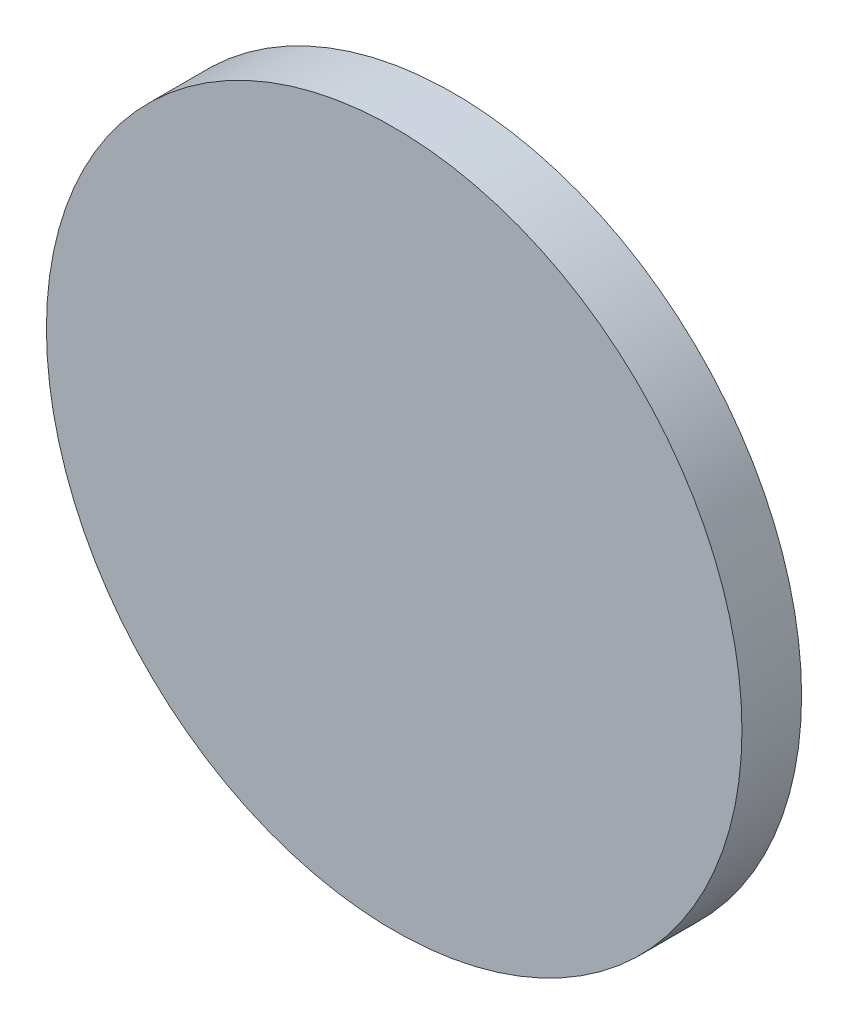
ISO-10303-21;
HEADER;
FILE_DESCRIPTION(('STEP AP214'),'2;1');
FILE_NAME('part.step','',(''),(''),'','','');
FILE_SCHEMA(('AUTOMOTIVE_DESIGN { 1 0 10303 214 1 1 1 1 }'));
ENDSEC;
DATA;
#1=APPLICATION_CONTEXT('core data for automotive mechanical design processes');
#2=APPLICATION_PROTOCOL_DEFINITION('international standard','automotive_design',2000,#1);
#3=PRODUCT_CONTEXT('',#1,'mechanical');
#4=PRODUCT('Part','Part','',(#3));
#5=PRODUCT_RELATED_PRODUCT_CATEGORY('part','',(#4));
#6=PRODUCT_DEFINITION_FORMATION('','',#4);
#7=PRODUCT_DEFINITION_CONTEXT('part definition',#1,'design');
#8=PRODUCT_DEFINITION('design','',#6,#7);
#9=PRODUCT_DEFINITION_SHAPE('','',#8);
#10=(LENGTH_UNIT() NAMED_UNIT(*) SI_UNIT(.MILLI.,.METRE.));
#11=(NAMED_UNIT(*) PLANE_ANGLE_UNIT() SI_UNIT($,.RADIAN.));
#12=(NAMED_UNIT(*) SI_UNIT($,.STERADIAN.) SOLID_ANGLE_UNIT());
#13=UNCERTAINTY_MEASURE_WITH_UNIT(LENGTH_MEASURE(1.E-05),#10,'distance_accuracy_value','');
#14=(GEOMETRIC_REPRESENTATION_CONTEXT(3) GLOBAL_UNCERTAINTY_ASSIGNED_CONTEXT((#13)) GLOBAL_UNIT_ASSIGNED_CONTEXT((#10,
#11,#12)) REPRESENTATION_CONTEXT('',''));
#15=CARTESIAN_POINT('',(0.,0.,0.));
#16=DIRECTION('',(0.,0.,1.));
#17=DIRECTION('',(1.,0.,0.));
#18=AXIS2_PLACEMENT_3D('',#15,#16,#17);
#19=CARTESIAN_POINT('',(3.3655,8.991600006176,0.76487));
#20=DIRECTION('',(0.,0.,-1.));
#21=DIRECTION('',(-1.,0.,0.));
#22=AXIS2_PLACEMENT_3D('',#19,#20,#21);
#23=PLANE('',#22);
#24=CARTESIAN_POINT('',(3.3655,8.991600006176,0.76487));
#25=DIRECTION('',(0.,0.,1.));
#26=DIRECTION('',(1.,0.,0.));
#27=AXIS2_PLACEMENT_3D('',#24,#25,#26);
#28=CIRCLE('',#27,0.200024667);
#29=CARTESIAN_POINT('',(3.565524667,8.991600006176,0.76487));
#30=VERTEX_POINT('',#29);
#31=EDGE_CURVE('E18',#30,#30,#28,.T.);
#32=ORIENTED_EDGE('',*,*,#31,.F.);
#33=EDGE_LOOP('',(#32));
#34=FACE_BOUND('',#33,.T.);
#35=ADVANCED_FACE('F15',(#34),#23,.T.);
#36=CARTESIAN_POINT('',(3.3655,8.991600006176,0.76487));
#37=DIRECTION('',(0.,0.,1.));
#38=DIRECTION('',(1.,0.,0.));
#39=AXIS2_PLACEMENT_3D('',#36,#37,#38);
#40=CYLINDRICAL_SURFACE('',#39,0.200024667);
#41=CARTESIAN_POINT('',(3.3655,8.991600006176,0.79916));
#42=DIRECTION('',(0.,0.,1.));
#43=DIRECTION('',(1.,0.,0.));
#44=AXIS2_PLACEMENT_3D('',#41,#42,#43);
#45=CIRCLE('',#44,0.200024667);
#46=CARTESIAN_POINT('',(3.565524667,8.991600006176,0.79916));
#47=VERTEX_POINT('',#46);
#48=EDGE_CURVE('E10',#47,#47,#45,.T.);
#49=ORIENTED_EDGE('',*,*,#48,.F.);
#50=EDGE_LOOP('',(#49));
#51=FACE_BOUND('',#50,.T.);
#52=ORIENTED_EDGE('',*,*,#31,.T.);
#53=EDGE_LOOP('',(#52));
#54=FACE_BOUND('',#53,.T.);
#55=ADVANCED_FACE('F27',(#51,#54),#40,.T.);
#56=CARTESIAN_POINT('',(3.3655,8.991600006176,0.79916));
#57=DIRECTION('',(0.,0.,1.));
#58=DIRECTION('',(1.,0.,0.));
#59=AXIS2_PLACEMENT_3D('',#56,#57,#58);
#60=PLANE('',#59);
#61=ORIENTED_EDGE('',*,*,#48,.T.);
#62=EDGE_LOOP('',(#61));
#63=FACE_BOUND('',#62,.T.);
#64=ADVANCED_FACE('F34',(#63),#60,.T.);
#65=CLOSED_SHELL('',(#35,#55,#64));
#66=MANIFOLD_SOLID_BREP('B1',#65);
#67=ADVANCED_BREP_SHAPE_REPRESENTATION('',(#18,#66),#14);
#68=SHAPE_DEFINITION_REPRESENTATION(#9,#67);
ENDSEC;
END-ISO-10303-21;
